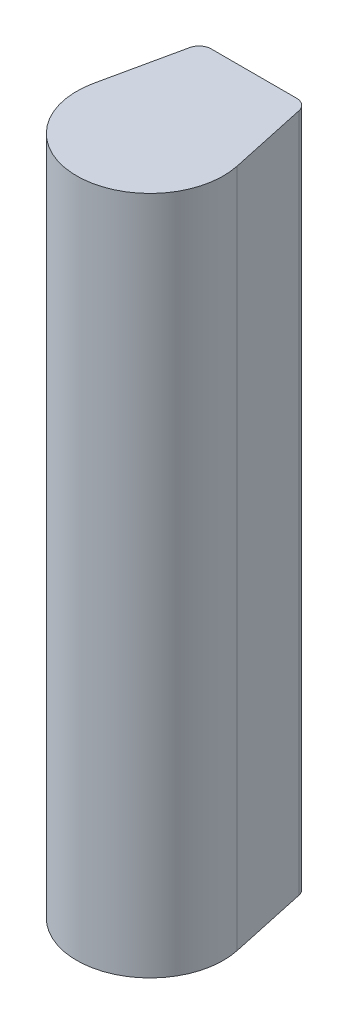
ISO-10303-21;
HEADER;
FILE_DESCRIPTION(('STEP AP214'),'2;1');
FILE_NAME('part.step','',(''),(''),'','','');
FILE_SCHEMA(('AUTOMOTIVE_DESIGN { 1 0 10303 214 1 1 1 1 }'));
ENDSEC;
DATA;
#1=APPLICATION_CONTEXT('core data for automotive mechanical design processes');
#2=APPLICATION_PROTOCOL_DEFINITION('international standard','automotive_design',2000,#1);
#3=PRODUCT_CONTEXT('',#1,'mechanical');
#4=PRODUCT('Part','Part','',(#3));
#5=PRODUCT_RELATED_PRODUCT_CATEGORY('part','',(#4));
#6=PRODUCT_DEFINITION_FORMATION('','',#4);
#7=PRODUCT_DEFINITION_CONTEXT('part definition',#1,'design');
#8=PRODUCT_DEFINITION('design','',#6,#7);
#9=PRODUCT_DEFINITION_SHAPE('','',#8);
#10=(LENGTH_UNIT() NAMED_UNIT(*) SI_UNIT(.MILLI.,.METRE.));
#11=(NAMED_UNIT(*) PLANE_ANGLE_UNIT() SI_UNIT($,.RADIAN.));
#12=(NAMED_UNIT(*) SI_UNIT($,.STERADIAN.) SOLID_ANGLE_UNIT());
#13=UNCERTAINTY_MEASURE_WITH_UNIT(LENGTH_MEASURE(1.E-05),#10,'distance_accuracy_value','');
#14=(GEOMETRIC_REPRESENTATION_CONTEXT(3) GLOBAL_UNCERTAINTY_ASSIGNED_CONTEXT((#13)) GLOBAL_UNIT_ASSIGNED_CONTEXT((#10,
#11,#12)) REPRESENTATION_CONTEXT('',''));
#15=CARTESIAN_POINT('',(0.,0.,0.));
#16=DIRECTION('',(0.,0.,1.));
#17=DIRECTION('',(1.,0.,0.));
#18=AXIS2_PLACEMENT_3D('',#15,#16,#17);
#19=CARTESIAN_POINT('',(-14.8954477623901,50.8,-3.22230289667326));
#20=DIRECTION('',(0.977391585458665,0.,0.21143719794444));
#21=DIRECTION('',(0.21143719794444,0.,-0.977391585458665));
#22=AXIS2_PLACEMENT_3D('',#19,#20,#21);
#23=PLANE('',#22);
#24=DIRECTION('',(0.,-1.,0.));
#25=VECTOR('',#24,1.);
#26=CARTESIAN_POINT('',(-14.8954477623901,50.8,-3.22230289667327));
#27=LINE('',#26,#25);
#28=CARTESIAN_POINT('',(-14.8954477623901,141.154547645774,-3.22230289667327));
#29=VERTEX_POINT('',#28);
#30=CARTESIAN_POINT('',(-14.8954477623901,0.,-3.22230289667327));
#31=VERTEX_POINT('',#30);
#32=EDGE_CURVE('E126',#29,#31,#27,.T.);
#33=ORIENTED_EDGE('',*,*,#32,.F.);
#34=DIRECTION('',(-0.21143719794444,0.,0.977391585458665));
#35=VECTOR('',#34,1.);
#36=CARTESIAN_POINT('',(-11.355294126782,141.154547645774,-19.5870504827789));
#37=LINE('',#36,#35);
#38=CARTESIAN_POINT('',(-11.355294126782,141.154547645774,-19.5870504827789));
#39=VERTEX_POINT('',#38);
#40=EDGE_CURVE('E109',#39,#29,#37,.T.);
#41=ORIENTED_EDGE('',*,*,#40,.F.);
#42=DIRECTION('',(0.,-1.,0.));
#43=VECTOR('',#42,1.);
#44=CARTESIAN_POINT('',(-11.355294126782,50.8,-19.5870504827789));
#45=LINE('',#44,#43);
#46=CARTESIAN_POINT('',(-11.355294126782,0.,-19.5870504827789));
#47=VERTEX_POINT('',#46);
#48=EDGE_CURVE('E129',#39,#47,#45,.T.);
#49=ORIENTED_EDGE('',*,*,#48,.T.);
#50=DIRECTION('',(-0.21143719794444,0.,0.977391585458665));
#51=VECTOR('',#50,1.);
#52=CARTESIAN_POINT('',(-14.8954477623901,0.,-3.22230289667326));
#53=LINE('',#52,#51);
#54=EDGE_CURVE('E115',#47,#31,#53,.T.);
#55=ORIENTED_EDGE('',*,*,#54,.T.);
#56=EDGE_LOOP('',(#33,#41,#49,#55));
#57=FACE_BOUND('',#56,.T.);
#58=ADVANCED_FACE('F33',(#57),#23,.F.);
#59=CARTESIAN_POINT('',(0.,50.8,0.));
#60=DIRECTION('',(0.,-1.,0.));
#61=DIRECTION('',(0.,0.,-1.));
#62=AXIS2_PLACEMENT_3D('',#59,#60,#61);
#63=CYLINDRICAL_SURFACE('',#62,15.24);
#64=CARTESIAN_POINT('',(0.,0.,0.));
#65=DIRECTION('',(0.,1.,0.));
#66=DIRECTION('',(0.,0.,1.));
#67=AXIS2_PLACEMENT_3D('',#64,#65,#66);
#68=CIRCLE('',#67,15.24);
#69=CARTESIAN_POINT('',(14.8954477623901,0.,-3.22230289667326));
#70=VERTEX_POINT('',#69);
#71=EDGE_CURVE('E117',#31,#70,#68,.T.);
#72=ORIENTED_EDGE('',*,*,#71,.T.);
#73=DIRECTION('',(0.,-1.,0.));
#74=VECTOR('',#73,1.);
#75=CARTESIAN_POINT('',(14.8954477623901,50.8,-3.22230289667326));
#76=LINE('',#75,#74);
#77=CARTESIAN_POINT('',(14.8954477623901,141.154547645774,-3.22230289667324));
#78=VERTEX_POINT('',#77);
#79=EDGE_CURVE('E123',#78,#70,#76,.T.);
#80=ORIENTED_EDGE('',*,*,#79,.F.);
#81=CARTESIAN_POINT('',(0.,141.154547645774,0.));
#82=DIRECTION('',(0.,1.,0.));
#83=DIRECTION('',(0.,0.,1.));
#84=AXIS2_PLACEMENT_3D('',#81,#82,#83);
#85=CIRCLE('',#84,15.24);
#86=EDGE_CURVE('E112',#29,#78,#85,.T.);
#87=ORIENTED_EDGE('',*,*,#86,.F.);
#88=ORIENTED_EDGE('',*,*,#32,.T.);
#89=EDGE_LOOP('',(#72,#80,#87,#88));
#90=FACE_BOUND('',#89,.T.);
#91=ADVANCED_FACE('F140',(#90),#63,.T.);
#92=CARTESIAN_POINT('',(14.8954477623901,50.8,-3.22230289667326));
#93=DIRECTION('',(-0.977391585458665,0.,0.21143719794444));
#94=DIRECTION('',(0.21143719794444,0.,0.977391585458665));
#95=AXIS2_PLACEMENT_3D('',#92,#93,#94);
#96=PLANE('',#95);
#97=DIRECTION('',(-0.21143719794444,0.,-0.977391585458665));
#98=VECTOR('',#97,1.);
#99=CARTESIAN_POINT('',(14.8954477623901,0.,-3.22230289667326));
#100=LINE('',#99,#98);
#101=CARTESIAN_POINT('',(11.355294126782,0.,-19.5870504827789));
#102=VERTEX_POINT('',#101);
#103=EDGE_CURVE('E119',#70,#102,#100,.T.);
#104=ORIENTED_EDGE('',*,*,#103,.T.);
#105=DIRECTION('',(0.,-1.,0.));
#106=VECTOR('',#105,1.);
#107=CARTESIAN_POINT('',(11.355294126782,50.8,-19.5870504827789));
#108=LINE('',#107,#106);
#109=CARTESIAN_POINT('',(11.355294126782,141.154547645774,-19.5870504827789));
#110=VERTEX_POINT('',#109);
#111=EDGE_CURVE('E11',#102,#110,#108,.F.);
#112=ORIENTED_EDGE('',*,*,#111,.T.);
#113=DIRECTION('',(-0.21143719794444,0.,-0.977391585458665));
#114=VECTOR('',#113,1.);
#115=CARTESIAN_POINT('',(14.8954477623901,141.154547645774,-3.22230289667326));
#116=LINE('',#115,#114);
#117=EDGE_CURVE('E105',#78,#110,#116,.T.);
#118=ORIENTED_EDGE('',*,*,#117,.F.);
#119=ORIENTED_EDGE('',*,*,#79,.T.);
#120=EDGE_LOOP('',(#104,#112,#118,#119));
#121=FACE_BOUND('',#120,.T.);
#122=ADVANCED_FACE('F153',(#121),#96,.F.);
#123=CARTESIAN_POINT('',(-10.922,50.8,-21.59));
#124=DIRECTION('',(0.,0.,1.));
#125=DIRECTION('',(1.,0.,0.));
#126=AXIS2_PLACEMENT_3D('',#123,#124,#125);
#127=PLANE('',#126);
#128=DIRECTION('',(-1.,0.,0.));
#129=VECTOR('',#128,1.);
#130=CARTESIAN_POINT('',(-10.922,0.,-21.59));
#131=LINE('',#130,#129);
#132=CARTESIAN_POINT('',(8.872719499717,0.,-21.59));
#133=VERTEX_POINT('',#132);
#134=CARTESIAN_POINT('',(-8.87271949971701,0.,-21.59));
#135=VERTEX_POINT('',#134);
#136=EDGE_CURVE('E121',#133,#135,#131,.T.);
#137=ORIENTED_EDGE('',*,*,#136,.T.);
#138=DIRECTION('',(0.,-1.,0.));
#139=VECTOR('',#138,1.);
#140=CARTESIAN_POINT('',(-8.87271949971701,50.8,-21.59));
#141=LINE('',#140,#139);
#142=CARTESIAN_POINT('',(-8.87271949971701,141.154547645774,-21.59));
#143=VERTEX_POINT('',#142);
#144=EDGE_CURVE('E41',#135,#143,#141,.F.);
#145=ORIENTED_EDGE('',*,*,#144,.T.);
#146=DIRECTION('',(-1.,0.,0.));
#147=VECTOR('',#146,1.);
#148=CARTESIAN_POINT('',(8.872719499717,141.154547645774,-21.59));
#149=LINE('',#148,#147);
#150=CARTESIAN_POINT('',(8.872719499717,141.154547645774,-21.59));
#151=VERTEX_POINT('',#150);
#152=EDGE_CURVE('E93',#151,#143,#149,.T.);
#153=ORIENTED_EDGE('',*,*,#152,.F.);
#154=DIRECTION('',(0.,-1.,0.));
#155=VECTOR('',#154,1.);
#156=CARTESIAN_POINT('',(8.872719499717,50.8,-21.59));
#157=LINE('',#156,#155);
#158=EDGE_CURVE('E85',#151,#133,#157,.T.);
#159=ORIENTED_EDGE('',*,*,#158,.T.);
#160=EDGE_LOOP('',(#137,#145,#153,#159));
#161=FACE_BOUND('',#160,.T.);
#162=ADVANCED_FACE('F94',(#161),#127,.F.);
#163=CARTESIAN_POINT('',(0.,0.,0.));
#164=DIRECTION('',(0.,1.,0.));
#165=DIRECTION('',(0.,0.,1.));
#166=AXIS2_PLACEMENT_3D('',#163,#164,#165);
#167=PLANE('',#166);
#168=ORIENTED_EDGE('',*,*,#54,.F.);
#169=CARTESIAN_POINT('',(-8.87271949971701,0.,-19.05));
#170=DIRECTION('',(0.,1.,0.));
#171=DIRECTION('',(0.,0.,1.));
#172=AXIS2_PLACEMENT_3D('',#169,#170,#171);
#173=CIRCLE('',#172,2.54);
#174=EDGE_CURVE('E54',#47,#135,#173,.F.);
#175=ORIENTED_EDGE('',*,*,#174,.T.);
#176=ORIENTED_EDGE('',*,*,#136,.F.);
#177=CARTESIAN_POINT('',(8.872719499717,0.,-19.05));
#178=DIRECTION('',(0.,1.,0.));
#179=DIRECTION('',(0.,0.,1.));
#180=AXIS2_PLACEMENT_3D('',#177,#178,#179);
#181=CIRCLE('',#180,2.54);
#182=EDGE_CURVE('E48',#133,#102,#181,.F.);
#183=ORIENTED_EDGE('',*,*,#182,.T.);
#184=ORIENTED_EDGE('',*,*,#103,.F.);
#185=ORIENTED_EDGE('',*,*,#71,.F.);
#186=EDGE_LOOP('',(#168,#175,#176,#183,#184,#185));
#187=FACE_BOUND('',#186,.T.);
#188=ADVANCED_FACE('F137',(#187),#167,.F.);
#189=CARTESIAN_POINT('',(-8.87271949971701,50.8,-19.05));
#190=DIRECTION('',(0.,-1.,0.));
#191=DIRECTION('',(0.,0.,-1.));
#192=AXIS2_PLACEMENT_3D('',#189,#190,#191);
#193=CYLINDRICAL_SURFACE('',#192,2.54);
#194=ORIENTED_EDGE('',*,*,#48,.F.);
#195=CARTESIAN_POINT('',(-8.87271949971701,141.154547645774,-19.05));
#196=DIRECTION('',(0.,1.,0.));
#197=DIRECTION('',(0.,0.,1.));
#198=AXIS2_PLACEMENT_3D('',#195,#196,#197);
#199=CIRCLE('',#198,2.54);
#200=EDGE_CURVE('E99',#143,#39,#199,.T.);
#201=ORIENTED_EDGE('',*,*,#200,.F.);
#202=ORIENTED_EDGE('',*,*,#144,.F.);
#203=ORIENTED_EDGE('',*,*,#174,.F.);
#204=EDGE_LOOP('',(#194,#201,#202,#203));
#205=FACE_BOUND('',#204,.T.);
#206=ADVANCED_FACE('F141',(#205),#193,.T.);
#207=CARTESIAN_POINT('',(8.872719499717,50.8,-19.05));
#208=DIRECTION('',(0.,-1.,0.));
#209=DIRECTION('',(0.,0.,-1.));
#210=AXIS2_PLACEMENT_3D('',#207,#208,#209);
#211=CYLINDRICAL_SURFACE('',#210,2.54);
#212=ORIENTED_EDGE('',*,*,#158,.F.);
#213=CARTESIAN_POINT('',(8.872719499717,141.154547645774,-19.05));
#214=DIRECTION('',(0.,1.,0.));
#215=DIRECTION('',(0.,0.,1.));
#216=AXIS2_PLACEMENT_3D('',#213,#214,#215);
#217=CIRCLE('',#216,2.54);
#218=EDGE_CURVE('E89',#110,#151,#217,.T.);
#219=ORIENTED_EDGE('',*,*,#218,.F.);
#220=ORIENTED_EDGE('',*,*,#111,.F.);
#221=ORIENTED_EDGE('',*,*,#182,.F.);
#222=EDGE_LOOP('',(#212,#219,#220,#221));
#223=FACE_BOUND('',#222,.T.);
#224=ADVANCED_FACE('F35',(#223),#211,.T.);
#225=CARTESIAN_POINT('',(8.872719499717,141.154547645774,-19.05));
#226=DIRECTION('',(0.,1.,0.));
#227=DIRECTION('',(0.,0.,1.));
#228=AXIS2_PLACEMENT_3D('',#225,#226,#227);
#229=PLANE('',#228);
#230=ORIENTED_EDGE('',*,*,#218,.T.);
#231=ORIENTED_EDGE('',*,*,#152,.T.);
#232=ORIENTED_EDGE('',*,*,#200,.T.);
#233=ORIENTED_EDGE('',*,*,#40,.T.);
#234=ORIENTED_EDGE('',*,*,#86,.T.);
#235=ORIENTED_EDGE('',*,*,#117,.T.);
#236=EDGE_LOOP('',(#230,#231,#232,#233,#234,#235));
#237=FACE_BOUND('',#236,.T.);
#238=ADVANCED_FACE('F102',(#237),#229,.T.);
#239=CLOSED_SHELL('',(#58,#91,#122,#162,#188,#206,#224,#238));
#240=MANIFOLD_SOLID_BREP('B2',#239);
#241=ADVANCED_BREP_SHAPE_REPRESENTATION('',(#18,#240),#14);
#242=SHAPE_DEFINITION_REPRESENTATION(#9,#241);
ENDSEC;
END-ISO-10303-21;
